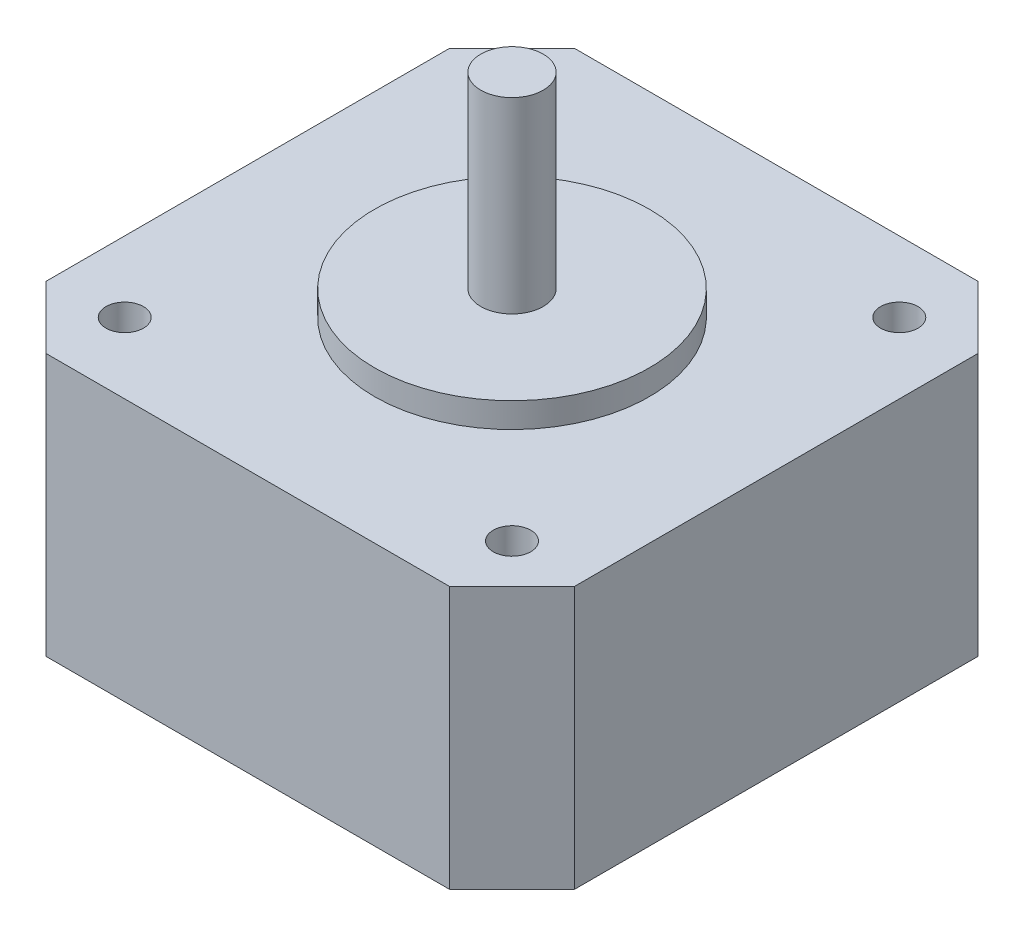
ISO-10303-21;
HEADER;
FILE_DESCRIPTION(('STEP AP214'),'2;1');
FILE_NAME('part.step','',(''),(''),'','','');
FILE_SCHEMA(('AUTOMOTIVE_DESIGN { 1 0 10303 214 1 1 1 1 }'));
ENDSEC;
DATA;
#1=APPLICATION_CONTEXT('core data for automotive mechanical design processes');
#2=APPLICATION_PROTOCOL_DEFINITION('international standard','automotive_design',2000,#1);
#3=PRODUCT_CONTEXT('',#1,'mechanical');
#4=PRODUCT('Part','Part','',(#3));
#5=PRODUCT_RELATED_PRODUCT_CATEGORY('part','',(#4));
#6=PRODUCT_DEFINITION_FORMATION('','',#4);
#7=PRODUCT_DEFINITION_CONTEXT('part definition',#1,'design');
#8=PRODUCT_DEFINITION('design','',#6,#7);
#9=PRODUCT_DEFINITION_SHAPE('','',#8);
#10=(LENGTH_UNIT() NAMED_UNIT(*) SI_UNIT(.MILLI.,.METRE.));
#11=(NAMED_UNIT(*) PLANE_ANGLE_UNIT() SI_UNIT($,.RADIAN.));
#12=(NAMED_UNIT(*) SI_UNIT($,.STERADIAN.) SOLID_ANGLE_UNIT());
#13=UNCERTAINTY_MEASURE_WITH_UNIT(LENGTH_MEASURE(1.E-05),#10,'distance_accuracy_value','');
#14=(GEOMETRIC_REPRESENTATION_CONTEXT(3) GLOBAL_UNCERTAINTY_ASSIGNED_CONTEXT((#13)) GLOBAL_UNIT_ASSIGNED_CONTEXT((#10,
#11,#12)) REPRESENTATION_CONTEXT('',''));
#15=CARTESIAN_POINT('',(0.,0.,0.));
#16=DIRECTION('',(0.,0.,1.));
#17=DIRECTION('',(1.,0.,0.));
#18=AXIS2_PLACEMENT_3D('',#15,#16,#17);
#19=CARTESIAN_POINT('',(21.15,21.,-21.15));
#20=DIRECTION('',(-1.,0.,0.));
#21=DIRECTION('',(0.,0.,1.));
#22=AXIS2_PLACEMENT_3D('',#19,#20,#21);
#23=PLANE('',#22);
#24=DIRECTION('',(0.,0.,-1.));
#25=VECTOR('',#24,1.);
#26=CARTESIAN_POINT('',(21.15,0.,-21.15));
#27=LINE('',#26,#25);
#28=CARTESIAN_POINT('',(21.15,0.,16.15));
#29=VERTEX_POINT('',#28);
#30=CARTESIAN_POINT('',(21.15,0.,-16.15));
#31=VERTEX_POINT('',#30);
#32=EDGE_CURVE('E187',#29,#31,#27,.T.);
#33=ORIENTED_EDGE('',*,*,#32,.T.);
#34=DIRECTION('',(0.,1.,0.));
#35=VECTOR('',#34,1.);
#36=CARTESIAN_POINT('',(21.15,21.,-16.15));
#37=LINE('',#36,#35);
#38=CARTESIAN_POINT('',(21.15,21.,-16.15));
#39=VERTEX_POINT('',#38);
#40=EDGE_CURVE('E43',#31,#39,#37,.T.);
#41=ORIENTED_EDGE('',*,*,#40,.T.);
#42=DIRECTION('',(0.,0.,-1.));
#43=VECTOR('',#42,1.);
#44=CARTESIAN_POINT('',(21.15,21.,-21.15));
#45=LINE('',#44,#43);
#46=CARTESIAN_POINT('',(21.15,21.,16.15));
#47=VERTEX_POINT('',#46);
#48=EDGE_CURVE('E137',#47,#39,#45,.T.);
#49=ORIENTED_EDGE('',*,*,#48,.F.);
#50=DIRECTION('',(0.,-1.,0.));
#51=VECTOR('',#50,1.);
#52=CARTESIAN_POINT('',(21.15,21.,16.15));
#53=LINE('',#52,#51);
#54=EDGE_CURVE('E178',#47,#29,#53,.T.);
#55=ORIENTED_EDGE('',*,*,#54,.T.);
#56=EDGE_LOOP('',(#33,#41,#49,#55));
#57=FACE_BOUND('',#56,.T.);
#58=ADVANCED_FACE('F39',(#57),#23,.F.);
#59=CARTESIAN_POINT('',(-21.15,21.,-21.15));
#60=DIRECTION('',(0.,0.,1.));
#61=DIRECTION('',(1.,0.,0.));
#62=AXIS2_PLACEMENT_3D('',#59,#60,#61);
#63=PLANE('',#62);
#64=DIRECTION('',(-1.,0.,0.));
#65=VECTOR('',#64,1.);
#66=CARTESIAN_POINT('',(-21.15,0.,-21.15));
#67=LINE('',#66,#65);
#68=CARTESIAN_POINT('',(16.15,0.,-21.15));
#69=VERTEX_POINT('',#68);
#70=CARTESIAN_POINT('',(-16.15,0.,-21.15));
#71=VERTEX_POINT('',#70);
#72=EDGE_CURVE('E144',#69,#71,#67,.T.);
#73=ORIENTED_EDGE('',*,*,#72,.T.);
#74=DIRECTION('',(0.,1.,0.));
#75=VECTOR('',#74,1.);
#76=CARTESIAN_POINT('',(-16.15,21.,-21.15));
#77=LINE('',#76,#75);
#78=CARTESIAN_POINT('',(-16.15,21.,-21.15));
#79=VERTEX_POINT('',#78);
#80=EDGE_CURVE('E56',#71,#79,#77,.T.);
#81=ORIENTED_EDGE('',*,*,#80,.T.);
#82=DIRECTION('',(-1.,0.,0.));
#83=VECTOR('',#82,1.);
#84=CARTESIAN_POINT('',(-21.15,21.,-21.15));
#85=LINE('',#84,#83);
#86=CARTESIAN_POINT('',(16.15,21.,-21.15));
#87=VERTEX_POINT('',#86);
#88=EDGE_CURVE('E142',#87,#79,#85,.T.);
#89=ORIENTED_EDGE('',*,*,#88,.F.);
#90=DIRECTION('',(0.,-1.,0.));
#91=VECTOR('',#90,1.);
#92=CARTESIAN_POINT('',(16.15,21.,-21.15));
#93=LINE('',#92,#91);
#94=EDGE_CURVE('E173',#87,#69,#93,.T.);
#95=ORIENTED_EDGE('',*,*,#94,.T.);
#96=EDGE_LOOP('',(#73,#81,#89,#95));
#97=FACE_BOUND('',#96,.T.);
#98=ADVANCED_FACE('F195',(#97),#63,.F.);
#99=CARTESIAN_POINT('',(-21.15,21.,-21.15));
#100=DIRECTION('',(1.,0.,0.));
#101=DIRECTION('',(0.,0.,-1.));
#102=AXIS2_PLACEMENT_3D('',#99,#100,#101);
#103=PLANE('',#102);
#104=DIRECTION('',(0.,0.,1.));
#105=VECTOR('',#104,1.);
#106=CARTESIAN_POINT('',(-21.15,0.,-21.15));
#107=LINE('',#106,#105);
#108=CARTESIAN_POINT('',(-21.15,0.,-16.15));
#109=VERTEX_POINT('',#108);
#110=CARTESIAN_POINT('',(-21.15,0.,16.15));
#111=VERTEX_POINT('',#110);
#112=EDGE_CURVE('E138',#109,#111,#107,.T.);
#113=ORIENTED_EDGE('',*,*,#112,.T.);
#114=DIRECTION('',(0.,1.,0.));
#115=VECTOR('',#114,1.);
#116=CARTESIAN_POINT('',(-21.15,21.,16.15));
#117=LINE('',#116,#115);
#118=CARTESIAN_POINT('',(-21.15,21.,16.15));
#119=VERTEX_POINT('',#118);
#120=EDGE_CURVE('E113',#111,#119,#117,.T.);
#121=ORIENTED_EDGE('',*,*,#120,.T.);
#122=DIRECTION('',(0.,0.,1.));
#123=VECTOR('',#122,1.);
#124=CARTESIAN_POINT('',(-21.15,21.,-21.15));
#125=LINE('',#124,#123);
#126=CARTESIAN_POINT('',(-21.15,21.,-16.15));
#127=VERTEX_POINT('',#126);
#128=EDGE_CURVE('E203',#127,#119,#125,.T.);
#129=ORIENTED_EDGE('',*,*,#128,.F.);
#130=DIRECTION('',(0.,-1.,0.));
#131=VECTOR('',#130,1.);
#132=CARTESIAN_POINT('',(-21.15,21.,-16.15));
#133=LINE('',#132,#131);
#134=EDGE_CURVE('E119',#127,#109,#133,.T.);
#135=ORIENTED_EDGE('',*,*,#134,.T.);
#136=EDGE_LOOP('',(#113,#121,#129,#135));
#137=FACE_BOUND('',#136,.T.);
#138=ADVANCED_FACE('F303',(#137),#103,.F.);
#139=CARTESIAN_POINT('',(-21.15,21.,21.15));
#140=DIRECTION('',(0.,0.,-1.));
#141=DIRECTION('',(-1.,0.,0.));
#142=AXIS2_PLACEMENT_3D('',#139,#140,#141);
#143=PLANE('',#142);
#144=DIRECTION('',(1.,0.,0.));
#145=VECTOR('',#144,1.);
#146=CARTESIAN_POINT('',(-21.15,21.,21.15));
#147=LINE('',#146,#145);
#148=CARTESIAN_POINT('',(-16.15,21.,21.15));
#149=VERTEX_POINT('',#148);
#150=CARTESIAN_POINT('',(16.15,21.,21.15));
#151=VERTEX_POINT('',#150);
#152=EDGE_CURVE('E129',#149,#151,#147,.T.);
#153=ORIENTED_EDGE('',*,*,#152,.F.);
#154=DIRECTION('',(0.,-1.,0.));
#155=VECTOR('',#154,1.);
#156=CARTESIAN_POINT('',(-16.15,21.,21.15));
#157=LINE('',#156,#155);
#158=CARTESIAN_POINT('',(-16.15,0.,21.15));
#159=VERTEX_POINT('',#158);
#160=EDGE_CURVE('E112',#149,#159,#157,.T.);
#161=ORIENTED_EDGE('',*,*,#160,.T.);
#162=DIRECTION('',(1.,0.,0.));
#163=VECTOR('',#162,1.);
#164=CARTESIAN_POINT('',(-21.15,0.,21.15));
#165=LINE('',#164,#163);
#166=CARTESIAN_POINT('',(16.15,0.,21.15));
#167=VERTEX_POINT('',#166);
#168=EDGE_CURVE('E126',#159,#167,#165,.T.);
#169=ORIENTED_EDGE('',*,*,#168,.T.);
#170=DIRECTION('',(0.,1.,0.));
#171=VECTOR('',#170,1.);
#172=CARTESIAN_POINT('',(16.15,21.,21.15));
#173=LINE('',#172,#171);
#174=EDGE_CURVE('E132',#167,#151,#173,.T.);
#175=ORIENTED_EDGE('',*,*,#174,.T.);
#176=EDGE_LOOP('',(#153,#161,#169,#175));
#177=FACE_BOUND('',#176,.T.);
#178=ADVANCED_FACE('F125',(#177),#143,.F.);
#179=CARTESIAN_POINT('',(0.,21.,0.));
#180=DIRECTION('',(0.,1.,0.));
#181=DIRECTION('',(0.,0.,1.));
#182=AXIS2_PLACEMENT_3D('',#179,#180,#181);
#183=PLANE('',#182);
#184=CARTESIAN_POINT('',(0.,21.,0.));
#185=DIRECTION('',(0.,1.,0.));
#186=DIRECTION('',(0.,0.,1.));
#187=AXIS2_PLACEMENT_3D('',#184,#185,#186);
#188=CIRCLE('',#187,11.);
#189=CARTESIAN_POINT('',(0.,21.,11.));
#190=VERTEX_POINT('',#189);
#191=EDGE_CURVE('E240',#190,#190,#188,.T.);
#192=ORIENTED_EDGE('',*,*,#191,.F.);
#193=EDGE_LOOP('',(#192));
#194=FACE_BOUND('',#193,.T.);
#195=CARTESIAN_POINT('',(-15.5,21.,15.5));
#196=DIRECTION('',(0.,1.,0.));
#197=DIRECTION('',(0.,0.,1.));
#198=AXIS2_PLACEMENT_3D('',#195,#196,#197);
#199=CIRCLE('',#198,1.5);
#200=CARTESIAN_POINT('',(-15.5,21.,17.));
#201=VERTEX_POINT('',#200);
#202=EDGE_CURVE('E216',#201,#201,#199,.T.);
#203=ORIENTED_EDGE('',*,*,#202,.F.);
#204=EDGE_LOOP('',(#203));
#205=FACE_BOUND('',#204,.T.);
#206=CARTESIAN_POINT('',(-15.5,21.,-15.5));
#207=DIRECTION('',(0.,1.,0.));
#208=DIRECTION('',(0.,0.,1.));
#209=AXIS2_PLACEMENT_3D('',#206,#207,#208);
#210=CIRCLE('',#209,1.5);
#211=CARTESIAN_POINT('',(-15.5,21.,-14.));
#212=VERTEX_POINT('',#211);
#213=EDGE_CURVE('E225',#212,#212,#210,.T.);
#214=ORIENTED_EDGE('',*,*,#213,.F.);
#215=EDGE_LOOP('',(#214));
#216=FACE_BOUND('',#215,.T.);
#217=CARTESIAN_POINT('',(15.5,21.,-15.5));
#218=DIRECTION('',(0.,1.,0.));
#219=DIRECTION('',(0.,0.,1.));
#220=AXIS2_PLACEMENT_3D('',#217,#218,#219);
#221=CIRCLE('',#220,1.5);
#222=CARTESIAN_POINT('',(15.5,21.,-14.));
#223=VERTEX_POINT('',#222);
#224=EDGE_CURVE('E233',#223,#223,#221,.T.);
#225=ORIENTED_EDGE('',*,*,#224,.F.);
#226=EDGE_LOOP('',(#225));
#227=FACE_BOUND('',#226,.T.);
#228=CARTESIAN_POINT('',(15.5,21.,15.5));
#229=DIRECTION('',(0.,1.,0.));
#230=DIRECTION('',(0.,0.,1.));
#231=AXIS2_PLACEMENT_3D('',#228,#229,#230);
#232=CIRCLE('',#231,1.5);
#233=CARTESIAN_POINT('',(15.5,21.,17.));
#234=VERTEX_POINT('',#233);
#235=EDGE_CURVE('E208',#234,#234,#232,.T.);
#236=ORIENTED_EDGE('',*,*,#235,.F.);
#237=EDGE_LOOP('',(#236));
#238=FACE_BOUND('',#237,.T.);
#239=ORIENTED_EDGE('',*,*,#128,.T.);
#240=DIRECTION('',(-0.707106781186546,0.,-0.707106781186549));
#241=VECTOR('',#240,1.);
#242=CARTESIAN_POINT('',(-18.65,21.,18.65));
#243=LINE('',#242,#241);
#244=EDGE_CURVE('E170',#119,#149,#243,.F.);
#245=ORIENTED_EDGE('',*,*,#244,.T.);
#246=ORIENTED_EDGE('',*,*,#152,.T.);
#247=DIRECTION('',(-0.707106781186548,0.,0.707106781186547));
#248=VECTOR('',#247,1.);
#249=CARTESIAN_POINT('',(18.65,21.,18.65));
#250=LINE('',#249,#248);
#251=EDGE_CURVE('E162',#151,#47,#250,.F.);
#252=ORIENTED_EDGE('',*,*,#251,.T.);
#253=ORIENTED_EDGE('',*,*,#48,.T.);
#254=DIRECTION('',(0.707106781186547,0.,0.707106781186548));
#255=VECTOR('',#254,1.);
#256=CARTESIAN_POINT('',(18.65,21.,-18.65));
#257=LINE('',#256,#255);
#258=EDGE_CURVE('E63',#39,#87,#257,.F.);
#259=ORIENTED_EDGE('',*,*,#258,.T.);
#260=ORIENTED_EDGE('',*,*,#88,.T.);
#261=DIRECTION('',(0.707106781186549,0.,-0.707106781186547));
#262=VECTOR('',#261,1.);
#263=CARTESIAN_POINT('',(-18.65,21.,-18.65));
#264=LINE('',#263,#262);
#265=EDGE_CURVE('E167',#79,#127,#264,.F.);
#266=ORIENTED_EDGE('',*,*,#265,.T.);
#267=EDGE_LOOP('',(#239,#245,#246,#252,#253,#259,#260,#266));
#268=FACE_BOUND('',#267,.T.);
#269=ADVANCED_FACE('F190',(#194,#205,#216,#227,#238,#268),#183,.T.);
#270=CARTESIAN_POINT('',(0.,0.,0.));
#271=DIRECTION('',(0.,1.,0.));
#272=DIRECTION('',(0.,0.,1.));
#273=AXIS2_PLACEMENT_3D('',#270,#271,#272);
#274=PLANE('',#273);
#275=ORIENTED_EDGE('',*,*,#168,.F.);
#276=DIRECTION('',(0.707106781186546,0.,0.707106781186549));
#277=VECTOR('',#276,1.);
#278=CARTESIAN_POINT('',(-16.15,0.,21.15));
#279=LINE('',#278,#277);
#280=EDGE_CURVE('E108',#159,#111,#279,.F.);
#281=ORIENTED_EDGE('',*,*,#280,.T.);
#282=ORIENTED_EDGE('',*,*,#112,.F.);
#283=DIRECTION('',(-0.707106781186549,0.,0.707106781186547));
#284=VECTOR('',#283,1.);
#285=CARTESIAN_POINT('',(-21.15,0.,-16.15));
#286=LINE('',#285,#284);
#287=EDGE_CURVE('E120',#109,#71,#286,.F.);
#288=ORIENTED_EDGE('',*,*,#287,.T.);
#289=ORIENTED_EDGE('',*,*,#72,.F.);
#290=DIRECTION('',(-0.707106781186547,0.,-0.707106781186548));
#291=VECTOR('',#290,1.);
#292=CARTESIAN_POINT('',(16.15,0.,-21.15));
#293=LINE('',#292,#291);
#294=EDGE_CURVE('E152',#69,#31,#293,.F.);
#295=ORIENTED_EDGE('',*,*,#294,.T.);
#296=ORIENTED_EDGE('',*,*,#32,.F.);
#297=DIRECTION('',(0.707106781186548,0.,-0.707106781186547));
#298=VECTOR('',#297,1.);
#299=CARTESIAN_POINT('',(21.15,0.,16.15));
#300=LINE('',#299,#298);
#301=EDGE_CURVE('E131',#29,#167,#300,.F.);
#302=ORIENTED_EDGE('',*,*,#301,.T.);
#303=EDGE_LOOP('',(#275,#281,#282,#288,#289,#295,#296,#302));
#304=FACE_BOUND('',#303,.T.);
#305=ADVANCED_FACE('F134',(#304),#274,.F.);
#306=CARTESIAN_POINT('',(-16.15,21.,21.15));
#307=DIRECTION('',(0.707106781186549,0.,-0.707106781186546));
#308=DIRECTION('',(0.,-1.,0.));
#309=AXIS2_PLACEMENT_3D('',#306,#307,#308);
#310=PLANE('',#309);
#311=ORIENTED_EDGE('',*,*,#244,.F.);
#312=ORIENTED_EDGE('',*,*,#120,.F.);
#313=ORIENTED_EDGE('',*,*,#280,.F.);
#314=ORIENTED_EDGE('',*,*,#160,.F.);
#315=EDGE_LOOP('',(#311,#312,#313,#314));
#316=FACE_BOUND('',#315,.T.);
#317=ADVANCED_FACE('F111',(#316),#310,.F.);
#318=CARTESIAN_POINT('',(-21.15,21.,-16.15));
#319=DIRECTION('',(0.707106781186547,0.,0.707106781186549));
#320=DIRECTION('',(0.,-1.,0.));
#321=AXIS2_PLACEMENT_3D('',#318,#319,#320);
#322=PLANE('',#321);
#323=ORIENTED_EDGE('',*,*,#265,.F.);
#324=ORIENTED_EDGE('',*,*,#80,.F.);
#325=ORIENTED_EDGE('',*,*,#287,.F.);
#326=ORIENTED_EDGE('',*,*,#134,.F.);
#327=EDGE_LOOP('',(#323,#324,#325,#326));
#328=FACE_BOUND('',#327,.T.);
#329=ADVANCED_FACE('F309',(#328),#322,.F.);
#330=CARTESIAN_POINT('',(16.15,21.,-21.15));
#331=DIRECTION('',(-0.707106781186548,0.,0.707106781186547));
#332=DIRECTION('',(0.,-1.,0.));
#333=AXIS2_PLACEMENT_3D('',#330,#331,#332);
#334=PLANE('',#333);
#335=ORIENTED_EDGE('',*,*,#258,.F.);
#336=ORIENTED_EDGE('',*,*,#40,.F.);
#337=ORIENTED_EDGE('',*,*,#294,.F.);
#338=ORIENTED_EDGE('',*,*,#94,.F.);
#339=EDGE_LOOP('',(#335,#336,#337,#338));
#340=FACE_BOUND('',#339,.T.);
#341=ADVANCED_FACE('F193',(#340),#334,.F.);
#342=CARTESIAN_POINT('',(21.15,21.,16.15));
#343=DIRECTION('',(-0.707106781186547,0.,-0.707106781186548));
#344=DIRECTION('',(0.,-1.,0.));
#345=AXIS2_PLACEMENT_3D('',#342,#343,#344);
#346=PLANE('',#345);
#347=ORIENTED_EDGE('',*,*,#251,.F.);
#348=ORIENTED_EDGE('',*,*,#174,.F.);
#349=ORIENTED_EDGE('',*,*,#301,.F.);
#350=ORIENTED_EDGE('',*,*,#54,.F.);
#351=EDGE_LOOP('',(#347,#348,#349,#350));
#352=FACE_BOUND('',#351,.T.);
#353=ADVANCED_FACE('F41',(#352),#346,.F.);
#354=CARTESIAN_POINT('',(15.5,18.,15.5));
#355=DIRECTION('',(0.,1.,0.));
#356=DIRECTION('',(0.,0.,1.));
#357=AXIS2_PLACEMENT_3D('',#354,#355,#356);
#358=CYLINDRICAL_SURFACE('',#357,1.5);
#359=CARTESIAN_POINT('',(15.5,18.,15.5));
#360=DIRECTION('',(0.,1.,0.));
#361=DIRECTION('',(0.,0.,1.));
#362=AXIS2_PLACEMENT_3D('',#359,#360,#361);
#363=CIRCLE('',#362,1.5);
#364=CARTESIAN_POINT('',(15.5,18.,17.));
#365=VERTEX_POINT('',#364);
#366=EDGE_CURVE('E198',#365,#365,#363,.T.);
#367=ORIENTED_EDGE('',*,*,#366,.F.);
#368=EDGE_LOOP('',(#367));
#369=FACE_BOUND('',#368,.T.);
#370=ORIENTED_EDGE('',*,*,#235,.T.);
#371=EDGE_LOOP('',(#370));
#372=FACE_BOUND('',#371,.T.);
#373=ADVANCED_FACE('F284',(#369,#372),#358,.F.);
#374=CARTESIAN_POINT('',(15.5,18.,15.5));
#375=DIRECTION('',(0.,1.,0.));
#376=DIRECTION('',(0.,0.,1.));
#377=AXIS2_PLACEMENT_3D('',#374,#375,#376);
#378=PLANE('',#377);
#379=ORIENTED_EDGE('',*,*,#366,.T.);
#380=EDGE_LOOP('',(#379));
#381=FACE_BOUND('',#380,.T.);
#382=ADVANCED_FACE('F286',(#381),#378,.T.);
#383=CARTESIAN_POINT('',(15.5,18.,-15.5));
#384=DIRECTION('',(0.,1.,0.));
#385=DIRECTION('',(0.,0.,1.));
#386=AXIS2_PLACEMENT_3D('',#383,#384,#385);
#387=CYLINDRICAL_SURFACE('',#386,1.5);
#388=CARTESIAN_POINT('',(15.5,18.,-15.5));
#389=DIRECTION('',(0.,1.,0.));
#390=DIRECTION('',(0.,0.,1.));
#391=AXIS2_PLACEMENT_3D('',#388,#389,#390);
#392=CIRCLE('',#391,1.5);
#393=CARTESIAN_POINT('',(15.5,18.,-14.));
#394=VERTEX_POINT('',#393);
#395=EDGE_CURVE('E212',#394,#394,#392,.T.);
#396=ORIENTED_EDGE('',*,*,#395,.F.);
#397=EDGE_LOOP('',(#396));
#398=FACE_BOUND('',#397,.T.);
#399=ORIENTED_EDGE('',*,*,#224,.T.);
#400=EDGE_LOOP('',(#399));
#401=FACE_BOUND('',#400,.T.);
#402=ADVANCED_FACE('F293',(#398,#401),#387,.F.);
#403=CARTESIAN_POINT('',(15.5,18.,-15.5));
#404=DIRECTION('',(0.,1.,0.));
#405=DIRECTION('',(0.,0.,1.));
#406=AXIS2_PLACEMENT_3D('',#403,#404,#405);
#407=PLANE('',#406);
#408=ORIENTED_EDGE('',*,*,#395,.T.);
#409=EDGE_LOOP('',(#408));
#410=FACE_BOUND('',#409,.T.);
#411=ADVANCED_FACE('F340',(#410),#407,.T.);
#412=CARTESIAN_POINT('',(-15.5,18.,-15.5));
#413=DIRECTION('',(0.,1.,0.));
#414=DIRECTION('',(0.,0.,1.));
#415=AXIS2_PLACEMENT_3D('',#412,#413,#414);
#416=CYLINDRICAL_SURFACE('',#415,1.5);
#417=CARTESIAN_POINT('',(-15.5,18.,-15.5));
#418=DIRECTION('',(0.,1.,0.));
#419=DIRECTION('',(0.,0.,1.));
#420=AXIS2_PLACEMENT_3D('',#417,#418,#419);
#421=CIRCLE('',#420,1.5);
#422=CARTESIAN_POINT('',(-15.5,18.,-14.));
#423=VERTEX_POINT('',#422);
#424=EDGE_CURVE('E229',#423,#423,#421,.T.);
#425=ORIENTED_EDGE('',*,*,#424,.F.);
#426=EDGE_LOOP('',(#425));
#427=FACE_BOUND('',#426,.T.);
#428=ORIENTED_EDGE('',*,*,#213,.T.);
#429=EDGE_LOOP('',(#428));
#430=FACE_BOUND('',#429,.T.);
#431=ADVANCED_FACE('F350',(#427,#430),#416,.F.);
#432=CARTESIAN_POINT('',(-15.5,18.,-15.5));
#433=DIRECTION('',(0.,1.,0.));
#434=DIRECTION('',(0.,0.,1.));
#435=AXIS2_PLACEMENT_3D('',#432,#433,#434);
#436=PLANE('',#435);
#437=ORIENTED_EDGE('',*,*,#424,.T.);
#438=EDGE_LOOP('',(#437));
#439=FACE_BOUND('',#438,.T.);
#440=ADVANCED_FACE('F360',(#439),#436,.T.);
#441=CARTESIAN_POINT('',(-15.5,18.,15.5));
#442=DIRECTION('',(0.,1.,0.));
#443=DIRECTION('',(0.,0.,1.));
#444=AXIS2_PLACEMENT_3D('',#441,#442,#443);
#445=CYLINDRICAL_SURFACE('',#444,1.5);
#446=CARTESIAN_POINT('',(-15.5,18.,15.5));
#447=DIRECTION('',(0.,1.,0.));
#448=DIRECTION('',(0.,0.,1.));
#449=AXIS2_PLACEMENT_3D('',#446,#447,#448);
#450=CIRCLE('',#449,1.5);
#451=CARTESIAN_POINT('',(-15.5,18.,17.));
#452=VERTEX_POINT('',#451);
#453=EDGE_CURVE('E220',#452,#452,#450,.T.);
#454=ORIENTED_EDGE('',*,*,#453,.F.);
#455=EDGE_LOOP('',(#454));
#456=FACE_BOUND('',#455,.T.);
#457=ORIENTED_EDGE('',*,*,#202,.T.);
#458=EDGE_LOOP('',(#457));
#459=FACE_BOUND('',#458,.T.);
#460=ADVANCED_FACE('F370',(#456,#459),#445,.F.);
#461=CARTESIAN_POINT('',(-15.5,18.,15.5));
#462=DIRECTION('',(0.,1.,0.));
#463=DIRECTION('',(0.,0.,1.));
#464=AXIS2_PLACEMENT_3D('',#461,#462,#463);
#465=PLANE('',#464);
#466=ORIENTED_EDGE('',*,*,#453,.T.);
#467=EDGE_LOOP('',(#466));
#468=FACE_BOUND('',#467,.T.);
#469=ADVANCED_FACE('F269',(#468),#465,.T.);
#470=CARTESIAN_POINT('',(0.,23.,0.));
#471=DIRECTION('',(0.,-1.,0.));
#472=DIRECTION('',(0.,0.,-1.));
#473=AXIS2_PLACEMENT_3D('',#470,#471,#472);
#474=CYLINDRICAL_SURFACE('',#473,11.);
#475=CARTESIAN_POINT('',(0.,23.,0.));
#476=DIRECTION('',(0.,1.,0.));
#477=DIRECTION('',(0.,0.,1.));
#478=AXIS2_PLACEMENT_3D('',#475,#476,#477);
#479=CIRCLE('',#478,11.);
#480=CARTESIAN_POINT('',(0.,23.,11.));
#481=VERTEX_POINT('',#480);
#482=EDGE_CURVE('E221',#481,#481,#479,.T.);
#483=ORIENTED_EDGE('',*,*,#482,.F.);
#484=EDGE_LOOP('',(#483));
#485=FACE_BOUND('',#484,.T.);
#486=ORIENTED_EDGE('',*,*,#191,.T.);
#487=EDGE_LOOP('',(#486));
#488=FACE_BOUND('',#487,.T.);
#489=ADVANCED_FACE('F263',(#485,#488),#474,.T.);
#490=CARTESIAN_POINT('',(0.,23.,0.));
#491=DIRECTION('',(0.,1.,0.));
#492=DIRECTION('',(0.,0.,1.));
#493=AXIS2_PLACEMENT_3D('',#490,#491,#492);
#494=PLANE('',#493);
#495=CARTESIAN_POINT('',(0.,23.,0.));
#496=DIRECTION('',(0.,1.,0.));
#497=DIRECTION('',(0.,0.,1.));
#498=AXIS2_PLACEMENT_3D('',#495,#496,#497);
#499=CIRCLE('',#498,2.5);
#500=CARTESIAN_POINT('',(0.,23.,2.5));
#501=VERTEX_POINT('',#500);
#502=EDGE_CURVE('E11',#501,#501,#499,.T.);
#503=ORIENTED_EDGE('',*,*,#502,.F.);
#504=EDGE_LOOP('',(#503));
#505=FACE_BOUND('',#504,.T.);
#506=ORIENTED_EDGE('',*,*,#482,.T.);
#507=EDGE_LOOP('',(#506));
#508=FACE_BOUND('',#507,.T.);
#509=ADVANCED_FACE('F257',(#505,#508),#494,.T.);
#510=CARTESIAN_POINT('',(0.,38.,0.));
#511=DIRECTION('',(0.,-1.,0.));
#512=DIRECTION('',(0.,0.,-1.));
#513=AXIS2_PLACEMENT_3D('',#510,#511,#512);
#514=CYLINDRICAL_SURFACE('',#513,2.5);
#515=CARTESIAN_POINT('',(0.,38.,0.));
#516=DIRECTION('',(0.,1.,0.));
#517=DIRECTION('',(0.,0.,1.));
#518=AXIS2_PLACEMENT_3D('',#515,#516,#517);
#519=CIRCLE('',#518,2.5);
#520=CARTESIAN_POINT('',(0.,38.,2.5));
#521=VERTEX_POINT('',#520);
#522=EDGE_CURVE('E244',#521,#521,#519,.T.);
#523=ORIENTED_EDGE('',*,*,#522,.F.);
#524=EDGE_LOOP('',(#523));
#525=FACE_BOUND('',#524,.T.);
#526=ORIENTED_EDGE('',*,*,#502,.T.);
#527=EDGE_LOOP('',(#526));
#528=FACE_BOUND('',#527,.T.);
#529=ADVANCED_FACE('F254',(#525,#528),#514,.T.);
#530=CARTESIAN_POINT('',(0.,38.,0.));
#531=DIRECTION('',(0.,1.,0.));
#532=DIRECTION('',(0.,0.,1.));
#533=AXIS2_PLACEMENT_3D('',#530,#531,#532);
#534=PLANE('',#533);
#535=ORIENTED_EDGE('',*,*,#522,.T.);
#536=EDGE_LOOP('',(#535));
#537=FACE_BOUND('',#536,.T.);
#538=ADVANCED_FACE('F252',(#537),#534,.T.);
#539=CLOSED_SHELL('',(#58,#98,#138,#178,#269,#305,#317,#329,#341,#353,#373,#382,#402,#411,#431,
#440,#460,#469,#489,#509,#529,#538));
#540=MANIFOLD_SOLID_BREP('B2',#539);
#541=ADVANCED_BREP_SHAPE_REPRESENTATION('',(#18,#540),#14);
#542=SHAPE_DEFINITION_REPRESENTATION(#9,#541);
ENDSEC;
END-ISO-10303-21;
